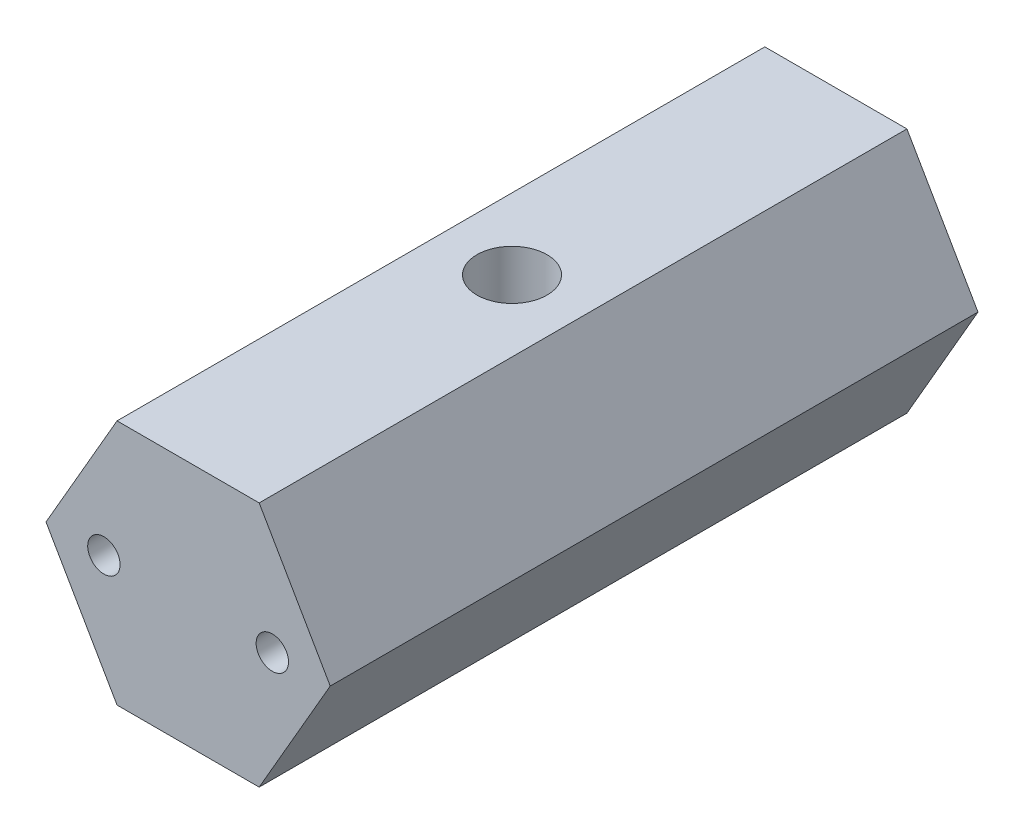
ISO-10303-21;
HEADER;
FILE_DESCRIPTION(('STEP AP214'),'2;1');
FILE_NAME('part.step','',(''),(''),'','','');
FILE_SCHEMA(('AUTOMOTIVE_DESIGN { 1 0 10303 214 1 1 1 1 }'));
ENDSEC;
DATA;
#1=APPLICATION_CONTEXT('core data for automotive mechanical design processes');
#2=APPLICATION_PROTOCOL_DEFINITION('international standard','automotive_design',2000,#1);
#3=PRODUCT_CONTEXT('',#1,'mechanical');
#4=PRODUCT('Part','Part','',(#3));
#5=PRODUCT_RELATED_PRODUCT_CATEGORY('part','',(#4));
#6=PRODUCT_DEFINITION_FORMATION('','',#4);
#7=PRODUCT_DEFINITION_CONTEXT('part definition',#1,'design');
#8=PRODUCT_DEFINITION('design','',#6,#7);
#9=PRODUCT_DEFINITION_SHAPE('','',#8);
#10=(LENGTH_UNIT() NAMED_UNIT(*) SI_UNIT(.MILLI.,.METRE.));
#11=(NAMED_UNIT(*) PLANE_ANGLE_UNIT() SI_UNIT($,.RADIAN.));
#12=(NAMED_UNIT(*) SI_UNIT($,.STERADIAN.) SOLID_ANGLE_UNIT());
#13=UNCERTAINTY_MEASURE_WITH_UNIT(LENGTH_MEASURE(1.E-05),#10,'distance_accuracy_value','');
#14=(GEOMETRIC_REPRESENTATION_CONTEXT(3) GLOBAL_UNCERTAINTY_ASSIGNED_CONTEXT((#13)) GLOBAL_UNIT_ASSIGNED_CONTEXT((#10,
#11,#12)) REPRESENTATION_CONTEXT('',''));
#15=CARTESIAN_POINT('',(0.,0.,0.));
#16=DIRECTION('',(0.,0.,1.));
#17=DIRECTION('',(1.,0.,0.));
#18=AXIS2_PLACEMENT_3D('',#15,#16,#17);
#19=CARTESIAN_POINT('',(5.48482755730145,9.5,25.));
#20=DIRECTION('',(0.,-1.,0.));
#21=DIRECTION('',(1.,0.,0.));
#22=AXIS2_PLACEMENT_3D('',#19,#20,#21);
#23=PLANE('',#22);
#24=DIRECTION('',(-1.,0.,0.));
#25=VECTOR('',#24,1.);
#26=CARTESIAN_POINT('',(5.48482755730145,9.5,-25.));
#27=LINE('',#26,#25);
#28=CARTESIAN_POINT('',(5.48482755730145,9.5,-25.));
#29=VERTEX_POINT('',#28);
#30=CARTESIAN_POINT('',(-5.48482755730144,9.5,-25.));
#31=VERTEX_POINT('',#30);
#32=EDGE_CURVE('E93',#29,#31,#27,.T.);
#33=ORIENTED_EDGE('',*,*,#32,.T.);
#34=DIRECTION('',(0.,0.,-1.));
#35=VECTOR('',#34,1.);
#36=CARTESIAN_POINT('',(-5.48482755730144,9.5,25.));
#37=LINE('',#36,#35);
#38=CARTESIAN_POINT('',(-5.48482755730144,9.5,25.));
#39=VERTEX_POINT('',#38);
#40=EDGE_CURVE('E133',#39,#31,#37,.T.);
#41=ORIENTED_EDGE('',*,*,#40,.F.);
#42=DIRECTION('',(-1.,0.,0.));
#43=VECTOR('',#42,1.);
#44=CARTESIAN_POINT('',(5.48482755730145,9.5,25.));
#45=LINE('',#44,#43);
#46=CARTESIAN_POINT('',(5.48482755730145,9.5,25.));
#47=VERTEX_POINT('',#46);
#48=EDGE_CURVE('E119',#47,#39,#45,.T.);
#49=ORIENTED_EDGE('',*,*,#48,.F.);
#50=DIRECTION('',(0.,0.,-1.));
#51=VECTOR('',#50,1.);
#52=CARTESIAN_POINT('',(5.48482755730145,9.5,25.));
#53=LINE('',#52,#51);
#54=EDGE_CURVE('E127',#47,#29,#53,.T.);
#55=ORIENTED_EDGE('',*,*,#54,.T.);
#56=EDGE_LOOP('',(#33,#41,#49,#55));
#57=FACE_BOUND('',#56,.T.);
#58=CARTESIAN_POINT('',(0.,9.5,0.));
#59=DIRECTION('',(0.,1.,0.));
#60=DIRECTION('',(0.,0.,1.));
#61=AXIS2_PLACEMENT_3D('',#58,#59,#60);
#62=CIRCLE('',#61,2.70509999999999);
#63=CARTESIAN_POINT('',(0.,9.5,2.70509999999999));
#64=VERTEX_POINT('',#63);
#65=EDGE_CURVE('E214',#64,#64,#62,.T.);
#66=ORIENTED_EDGE('',*,*,#65,.F.);
#67=EDGE_LOOP('',(#66));
#68=FACE_BOUND('',#67,.T.);
#69=ADVANCED_FACE('F52',(#57,#68),#23,.F.);
#70=CARTESIAN_POINT('',(0.,0.,25.));
#71=DIRECTION('',(0.,0.,1.));
#72=DIRECTION('',(1.,0.,0.));
#73=AXIS2_PLACEMENT_3D('',#70,#71,#72);
#74=PLANE('',#73);
#75=CARTESIAN_POINT('',(-6.5,0.,25.));
#76=DIRECTION('',(0.,0.,1.));
#77=DIRECTION('',(1.,0.,0.));
#78=AXIS2_PLACEMENT_3D('',#75,#76,#77);
#79=CIRCLE('',#78,1.25);
#80=CARTESIAN_POINT('',(-5.25,0.,25.));
#81=VERTEX_POINT('',#80);
#82=EDGE_CURVE('E148',#81,#81,#79,.T.);
#83=ORIENTED_EDGE('',*,*,#82,.F.);
#84=EDGE_LOOP('',(#83));
#85=FACE_BOUND('',#84,.T.);
#86=DIRECTION('',(0.5,-0.866025403784438,0.));
#87=VECTOR('',#86,1.);
#88=CARTESIAN_POINT('',(-10.9696551146029,0.,25.));
#89=LINE('',#88,#87);
#90=CARTESIAN_POINT('',(-10.9696551146029,0.,25.));
#91=VERTEX_POINT('',#90);
#92=CARTESIAN_POINT('',(-5.48482755730144,-9.5,25.));
#93=VERTEX_POINT('',#92);
#94=EDGE_CURVE('E160',#91,#93,#89,.T.);
#95=ORIENTED_EDGE('',*,*,#94,.T.);
#96=DIRECTION('',(1.,0.,0.));
#97=VECTOR('',#96,1.);
#98=CARTESIAN_POINT('',(-5.48482755730144,-9.5,25.));
#99=LINE('',#98,#97);
#100=CARTESIAN_POINT('',(5.48482755730145,-9.5,25.));
#101=VERTEX_POINT('',#100);
#102=EDGE_CURVE('E107',#93,#101,#99,.T.);
#103=ORIENTED_EDGE('',*,*,#102,.T.);
#104=DIRECTION('',(0.5,0.866025403784439,0.));
#105=VECTOR('',#104,1.);
#106=CARTESIAN_POINT('',(5.48482755730145,-9.5,25.));
#107=LINE('',#106,#105);
#108=CARTESIAN_POINT('',(10.9696551146029,0.,25.));
#109=VERTEX_POINT('',#108);
#110=EDGE_CURVE('E121',#101,#109,#107,.T.);
#111=ORIENTED_EDGE('',*,*,#110,.T.);
#112=DIRECTION('',(-0.5,0.866025403784439,0.));
#113=VECTOR('',#112,1.);
#114=CARTESIAN_POINT('',(10.9696551146029,0.,25.));
#115=LINE('',#114,#113);
#116=EDGE_CURVE('E114',#109,#47,#115,.T.);
#117=ORIENTED_EDGE('',*,*,#116,.T.);
#118=ORIENTED_EDGE('',*,*,#48,.T.);
#119=DIRECTION('',(-0.5,-0.866025403784439,0.));
#120=VECTOR('',#119,1.);
#121=CARTESIAN_POINT('',(-5.48482755730144,9.5,25.));
#122=LINE('',#121,#120);
#123=EDGE_CURVE('E70',#39,#91,#122,.T.);
#124=ORIENTED_EDGE('',*,*,#123,.T.);
#125=EDGE_LOOP('',(#95,#103,#111,#117,#118,#124));
#126=FACE_BOUND('',#125,.T.);
#127=CARTESIAN_POINT('',(6.5,0.,25.));
#128=DIRECTION('',(0.,0.,1.));
#129=DIRECTION('',(1.,0.,0.));
#130=AXIS2_PLACEMENT_3D('',#127,#128,#129);
#131=CIRCLE('',#130,1.25);
#132=CARTESIAN_POINT('',(7.75,0.,25.));
#133=VERTEX_POINT('',#132);
#134=EDGE_CURVE('E219',#133,#133,#131,.T.);
#135=ORIENTED_EDGE('',*,*,#134,.F.);
#136=EDGE_LOOP('',(#135));
#137=FACE_BOUND('',#136,.T.);
#138=ADVANCED_FACE('F116',(#85,#126,#137),#74,.T.);
#139=CARTESIAN_POINT('',(0.,0.,-25.));
#140=DIRECTION('',(0.,0.,1.));
#141=DIRECTION('',(1.,0.,0.));
#142=AXIS2_PLACEMENT_3D('',#139,#140,#141);
#143=PLANE('',#142);
#144=DIRECTION('',(0.5,-0.866025403784438,0.));
#145=VECTOR('',#144,1.);
#146=CARTESIAN_POINT('',(-10.9696551146029,0.,-25.));
#147=LINE('',#146,#145);
#148=CARTESIAN_POINT('',(-10.9696551146029,0.,-25.));
#149=VERTEX_POINT('',#148);
#150=CARTESIAN_POINT('',(-5.48482755730144,-9.5,-25.));
#151=VERTEX_POINT('',#150);
#152=EDGE_CURVE('E143',#149,#151,#147,.T.);
#153=ORIENTED_EDGE('',*,*,#152,.F.);
#154=DIRECTION('',(-0.5,-0.866025403784439,0.));
#155=VECTOR('',#154,1.);
#156=CARTESIAN_POINT('',(-5.48482755730144,9.5,-25.));
#157=LINE('',#156,#155);
#158=EDGE_CURVE('E99',#31,#149,#157,.T.);
#159=ORIENTED_EDGE('',*,*,#158,.F.);
#160=ORIENTED_EDGE('',*,*,#32,.F.);
#161=DIRECTION('',(-0.5,0.866025403784439,0.));
#162=VECTOR('',#161,1.);
#163=CARTESIAN_POINT('',(10.9696551146029,0.,-25.));
#164=LINE('',#163,#162);
#165=CARTESIAN_POINT('',(10.9696551146029,0.,-25.));
#166=VERTEX_POINT('',#165);
#167=EDGE_CURVE('E130',#166,#29,#164,.T.);
#168=ORIENTED_EDGE('',*,*,#167,.F.);
#169=DIRECTION('',(0.5,0.866025403784439,0.));
#170=VECTOR('',#169,1.);
#171=CARTESIAN_POINT('',(5.48482755730145,-9.5,-25.));
#172=LINE('',#171,#170);
#173=CARTESIAN_POINT('',(5.48482755730145,-9.5,-25.));
#174=VERTEX_POINT('',#173);
#175=EDGE_CURVE('E151',#174,#166,#172,.T.);
#176=ORIENTED_EDGE('',*,*,#175,.F.);
#177=DIRECTION('',(1.,0.,0.));
#178=VECTOR('',#177,1.);
#179=CARTESIAN_POINT('',(-5.48482755730144,-9.5,-25.));
#180=LINE('',#179,#178);
#181=EDGE_CURVE('E147',#151,#174,#180,.T.);
#182=ORIENTED_EDGE('',*,*,#181,.F.);
#183=EDGE_LOOP('',(#153,#159,#160,#168,#176,#182));
#184=FACE_BOUND('',#183,.T.);
#185=CARTESIAN_POINT('',(-6.5,0.,-25.));
#186=DIRECTION('',(0.,0.,1.));
#187=DIRECTION('',(1.,0.,0.));
#188=AXIS2_PLACEMENT_3D('',#185,#186,#187);
#189=CIRCLE('',#188,1.25);
#190=CARTESIAN_POINT('',(-5.25,0.,-25.));
#191=VERTEX_POINT('',#190);
#192=EDGE_CURVE('E226',#191,#191,#189,.T.);
#193=ORIENTED_EDGE('',*,*,#192,.T.);
#194=EDGE_LOOP('',(#193));
#195=FACE_BOUND('',#194,.T.);
#196=CARTESIAN_POINT('',(6.5,0.,-25.));
#197=DIRECTION('',(0.,0.,1.));
#198=DIRECTION('',(1.,0.,0.));
#199=AXIS2_PLACEMENT_3D('',#196,#197,#198);
#200=CIRCLE('',#199,1.25);
#201=CARTESIAN_POINT('',(7.75,0.,-25.));
#202=VERTEX_POINT('',#201);
#203=EDGE_CURVE('E213',#202,#202,#200,.T.);
#204=ORIENTED_EDGE('',*,*,#203,.T.);
#205=EDGE_LOOP('',(#204));
#206=FACE_BOUND('',#205,.T.);
#207=ADVANCED_FACE('F173',(#184,#195,#206),#143,.F.);
#208=CARTESIAN_POINT('',(-10.9696551146029,0.,25.));
#209=DIRECTION('',(0.866025403784438,0.5,0.));
#210=DIRECTION('',(-0.5,0.866025403784439,0.));
#211=AXIS2_PLACEMENT_3D('',#208,#209,#210);
#212=PLANE('',#211);
#213=ORIENTED_EDGE('',*,*,#152,.T.);
#214=DIRECTION('',(0.,0.,-1.));
#215=VECTOR('',#214,1.);
#216=CARTESIAN_POINT('',(-5.48482755730144,-9.5,25.));
#217=LINE('',#216,#215);
#218=EDGE_CURVE('E11',#93,#151,#217,.T.);
#219=ORIENTED_EDGE('',*,*,#218,.F.);
#220=ORIENTED_EDGE('',*,*,#94,.F.);
#221=DIRECTION('',(0.,0.,-1.));
#222=VECTOR('',#221,1.);
#223=CARTESIAN_POINT('',(-10.9696551146029,0.,25.));
#224=LINE('',#223,#222);
#225=EDGE_CURVE('E139',#91,#149,#224,.T.);
#226=ORIENTED_EDGE('',*,*,#225,.T.);
#227=EDGE_LOOP('',(#213,#219,#220,#226));
#228=FACE_BOUND('',#227,.T.);
#229=ADVANCED_FACE('F54',(#228),#212,.F.);
#230=CARTESIAN_POINT('',(-5.48482755730144,-9.5,25.));
#231=DIRECTION('',(0.,1.,0.));
#232=DIRECTION('',(-1.,0.,0.));
#233=AXIS2_PLACEMENT_3D('',#230,#231,#232);
#234=PLANE('',#233);
#235=CARTESIAN_POINT('',(0.,-9.5,0.));
#236=DIRECTION('',(0.,1.,0.));
#237=DIRECTION('',(-1.,0.,0.));
#238=AXIS2_PLACEMENT_3D('',#235,#236,#237);
#239=CIRCLE('',#238,2.70509999999999);
#240=CARTESIAN_POINT('',(-2.70509999999999,-9.5,0.));
#241=VERTEX_POINT('',#240);
#242=EDGE_CURVE('E210',#241,#241,#239,.T.);
#243=ORIENTED_EDGE('',*,*,#242,.T.);
#244=EDGE_LOOP('',(#243));
#245=FACE_BOUND('',#244,.T.);
#246=ORIENTED_EDGE('',*,*,#181,.T.);
#247=DIRECTION('',(0.,0.,-1.));
#248=VECTOR('',#247,1.);
#249=CARTESIAN_POINT('',(5.48482755730145,-9.5,25.));
#250=LINE('',#249,#248);
#251=EDGE_CURVE('E62',#101,#174,#250,.T.);
#252=ORIENTED_EDGE('',*,*,#251,.F.);
#253=ORIENTED_EDGE('',*,*,#102,.F.);
#254=ORIENTED_EDGE('',*,*,#218,.T.);
#255=EDGE_LOOP('',(#246,#252,#253,#254));
#256=FACE_BOUND('',#255,.T.);
#257=ADVANCED_FACE('F201',(#245,#256),#234,.F.);
#258=CARTESIAN_POINT('',(5.48482755730145,-9.5,25.));
#259=DIRECTION('',(-0.866025403784439,0.5,0.));
#260=DIRECTION('',(-0.5,-0.866025403784439,0.));
#261=AXIS2_PLACEMENT_3D('',#258,#259,#260);
#262=PLANE('',#261);
#263=ORIENTED_EDGE('',*,*,#175,.T.);
#264=DIRECTION('',(0.,0.,-1.));
#265=VECTOR('',#264,1.);
#266=CARTESIAN_POINT('',(10.9696551146029,0.,25.));
#267=LINE('',#266,#265);
#268=EDGE_CURVE('E132',#109,#166,#267,.T.);
#269=ORIENTED_EDGE('',*,*,#268,.F.);
#270=ORIENTED_EDGE('',*,*,#110,.F.);
#271=ORIENTED_EDGE('',*,*,#251,.T.);
#272=EDGE_LOOP('',(#263,#269,#270,#271));
#273=FACE_BOUND('',#272,.T.);
#274=ADVANCED_FACE('F170',(#273),#262,.F.);
#275=CARTESIAN_POINT('',(10.9696551146029,0.,25.));
#276=DIRECTION('',(-0.866025403784439,-0.5,0.));
#277=DIRECTION('',(0.5,-0.866025403784439,0.));
#278=AXIS2_PLACEMENT_3D('',#275,#276,#277);
#279=PLANE('',#278);
#280=ORIENTED_EDGE('',*,*,#167,.T.);
#281=ORIENTED_EDGE('',*,*,#54,.F.);
#282=ORIENTED_EDGE('',*,*,#116,.F.);
#283=ORIENTED_EDGE('',*,*,#268,.T.);
#284=EDGE_LOOP('',(#280,#281,#282,#283));
#285=FACE_BOUND('',#284,.T.);
#286=ADVANCED_FACE('F128',(#285),#279,.F.);
#287=CARTESIAN_POINT('',(-5.48482755730144,9.5,25.));
#288=DIRECTION('',(0.866025403784439,-0.5,0.));
#289=DIRECTION('',(0.5,0.866025403784439,0.));
#290=AXIS2_PLACEMENT_3D('',#287,#288,#289);
#291=PLANE('',#290);
#292=ORIENTED_EDGE('',*,*,#158,.T.);
#293=ORIENTED_EDGE('',*,*,#225,.F.);
#294=ORIENTED_EDGE('',*,*,#123,.F.);
#295=ORIENTED_EDGE('',*,*,#40,.T.);
#296=EDGE_LOOP('',(#292,#293,#294,#295));
#297=FACE_BOUND('',#296,.T.);
#298=ADVANCED_FACE('F178',(#297),#291,.F.);
#299=CARTESIAN_POINT('',(-6.5,0.,25.));
#300=DIRECTION('',(0.,0.,-1.));
#301=DIRECTION('',(-1.,0.,0.));
#302=AXIS2_PLACEMENT_3D('',#299,#300,#301);
#303=CYLINDRICAL_SURFACE('',#302,1.25);
#304=ORIENTED_EDGE('',*,*,#82,.T.);
#305=EDGE_LOOP('',(#304));
#306=FACE_BOUND('',#305,.T.);
#307=ORIENTED_EDGE('',*,*,#192,.F.);
#308=EDGE_LOOP('',(#307));
#309=FACE_BOUND('',#308,.T.);
#310=ADVANCED_FACE('F180',(#306,#309),#303,.F.);
#311=CARTESIAN_POINT('',(6.5,0.,25.));
#312=DIRECTION('',(0.,0.,-1.));
#313=DIRECTION('',(-1.,0.,0.));
#314=AXIS2_PLACEMENT_3D('',#311,#312,#313);
#315=CYLINDRICAL_SURFACE('',#314,1.25);
#316=ORIENTED_EDGE('',*,*,#134,.T.);
#317=EDGE_LOOP('',(#316));
#318=FACE_BOUND('',#317,.T.);
#319=ORIENTED_EDGE('',*,*,#203,.F.);
#320=EDGE_LOOP('',(#319));
#321=FACE_BOUND('',#320,.T.);
#322=ADVANCED_FACE('F186',(#318,#321),#315,.F.);
#323=CARTESIAN_POINT('',(0.,9.5,0.));
#324=DIRECTION('',(0.,1.,0.));
#325=DIRECTION('',(0.,0.,1.));
#326=AXIS2_PLACEMENT_3D('',#323,#324,#325);
#327=CYLINDRICAL_SURFACE('',#326,2.70509999999999);
#328=ORIENTED_EDGE('',*,*,#242,.F.);
#329=EDGE_LOOP('',(#328));
#330=FACE_BOUND('',#329,.T.);
#331=ORIENTED_EDGE('',*,*,#65,.T.);
#332=EDGE_LOOP('',(#331));
#333=FACE_BOUND('',#332,.T.);
#334=ADVANCED_FACE('F245',(#330,#333),#327,.F.);
#335=CLOSED_SHELL('',(#69,#138,#207,#229,#257,#274,#286,#298,#310,#322,#334));
#336=MANIFOLD_SOLID_BREP('B2',#335);
#337=ADVANCED_BREP_SHAPE_REPRESENTATION('',(#18,#336),#14);
#338=SHAPE_DEFINITION_REPRESENTATION(#9,#337);
ENDSEC;
END-ISO-10303-21;
